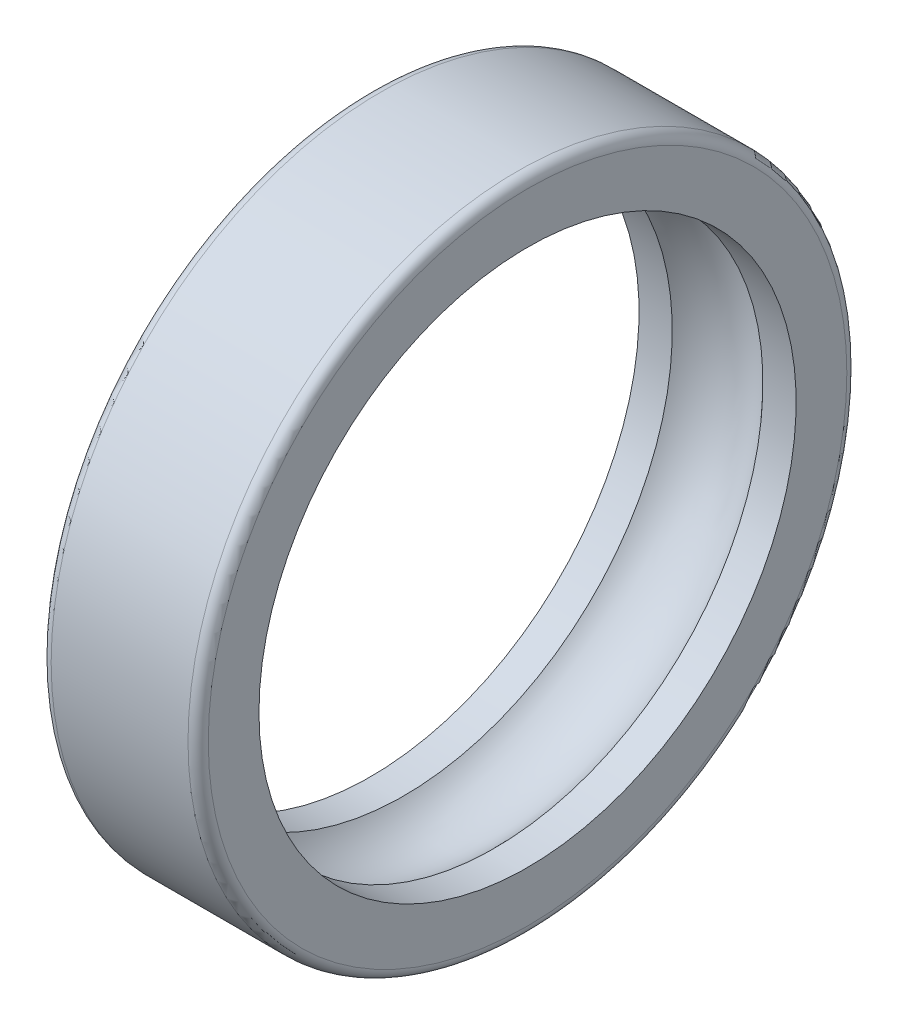
ISO-10303-21;
HEADER;
FILE_DESCRIPTION(('STEP AP214'),'2;1');
FILE_NAME('part.step','',(''),(''),'','','');
FILE_SCHEMA(('AUTOMOTIVE_DESIGN { 1 0 10303 214 1 1 1 1 }'));
ENDSEC;
DATA;
#1=APPLICATION_CONTEXT('core data for automotive mechanical design processes');
#2=APPLICATION_PROTOCOL_DEFINITION('international standard','automotive_design',2000,#1);
#3=PRODUCT_CONTEXT('',#1,'mechanical');
#4=PRODUCT('Part','Part','',(#3));
#5=PRODUCT_RELATED_PRODUCT_CATEGORY('part','',(#4));
#6=PRODUCT_DEFINITION_FORMATION('','',#4);
#7=PRODUCT_DEFINITION_CONTEXT('part definition',#1,'design');
#8=PRODUCT_DEFINITION('design','',#6,#7);
#9=PRODUCT_DEFINITION_SHAPE('','',#8);
#10=(LENGTH_UNIT() NAMED_UNIT(*) SI_UNIT(.MILLI.,.METRE.));
#11=(NAMED_UNIT(*) PLANE_ANGLE_UNIT() SI_UNIT($,.RADIAN.));
#12=(NAMED_UNIT(*) SI_UNIT($,.STERADIAN.) SOLID_ANGLE_UNIT());
#13=UNCERTAINTY_MEASURE_WITH_UNIT(LENGTH_MEASURE(1.E-05),#10,'distance_accuracy_value','');
#14=(GEOMETRIC_REPRESENTATION_CONTEXT(3) GLOBAL_UNCERTAINTY_ASSIGNED_CONTEXT((#13)) GLOBAL_UNIT_ASSIGNED_CONTEXT((#10,
#11,#12)) REPRESENTATION_CONTEXT('',''));
#15=CARTESIAN_POINT('',(0.,0.,0.));
#16=DIRECTION('',(0.,0.,1.));
#17=DIRECTION('',(1.,0.,0.));
#18=AXIS2_PLACEMENT_3D('',#15,#16,#17);
#19=CARTESIAN_POINT('',(-15.5,0.,0.));
#20=DIRECTION('',(-1.,0.,0.));
#21=DIRECTION('',(0.,0.,1.));
#22=AXIS2_PLACEMENT_3D('',#19,#20,#21);
#23=CYLINDRICAL_SURFACE('',#22,53.);
#24=CARTESIAN_POINT('',(-8.94427190999916,0.,0.));
#25=DIRECTION('',(-1.,0.,0.));
#26=DIRECTION('',(0.,0.,1.));
#27=AXIS2_PLACEMENT_3D('',#24,#25,#26);
#28=CIRCLE('',#27,53.);
#29=CARTESIAN_POINT('',(-8.94427190999916,0.,53.));
#30=VERTEX_POINT('',#29);
#31=EDGE_CURVE('E73',#30,#30,#28,.T.);
#32=ORIENTED_EDGE('',*,*,#31,.F.);
#33=EDGE_LOOP('',(#32));
#34=FACE_BOUND('',#33,.T.);
#35=CARTESIAN_POINT('',(-15.5,0.,0.));
#36=DIRECTION('',(-1.,0.,0.));
#37=DIRECTION('',(0.,0.,1.));
#38=AXIS2_PLACEMENT_3D('',#35,#36,#37);
#39=CIRCLE('',#38,53.);
#40=CARTESIAN_POINT('',(-15.5,0.,53.));
#41=VERTEX_POINT('',#40);
#42=EDGE_CURVE('E61',#41,#41,#39,.T.);
#43=ORIENTED_EDGE('',*,*,#42,.T.);
#44=EDGE_LOOP('',(#43));
#45=FACE_BOUND('',#44,.T.);
#46=ADVANCED_FACE('F37',(#34,#45),#23,.F.);
#47=CARTESIAN_POINT('',(-15.5,65.,0.));
#48=DIRECTION('',(1.,0.,0.));
#49=DIRECTION('',(0.,0.,-1.));
#50=AXIS2_PLACEMENT_3D('',#47,#48,#49);
#51=PLANE('',#50);
#52=CARTESIAN_POINT('',(-15.5,0.,0.));
#53=DIRECTION('',(1.,0.,0.));
#54=DIRECTION('',(0.,0.,-1.));
#55=AXIS2_PLACEMENT_3D('',#52,#53,#54);
#56=CIRCLE('',#55,63.);
#57=CARTESIAN_POINT('',(-15.5,0.,-63.));
#58=VERTEX_POINT('',#57);
#59=EDGE_CURVE('E10',#58,#58,#56,.F.);
#60=ORIENTED_EDGE('',*,*,#59,.T.);
#61=EDGE_LOOP('',(#60));
#62=FACE_BOUND('',#61,.T.);
#63=ORIENTED_EDGE('',*,*,#42,.F.);
#64=EDGE_LOOP('',(#63));
#65=FACE_BOUND('',#64,.T.);
#66=ADVANCED_FACE('F82',(#62,#65),#51,.F.);
#67=CARTESIAN_POINT('',(-15.5,0.,0.));
#68=DIRECTION('',(-1.,0.,0.));
#69=DIRECTION('',(0.,0.,1.));
#70=AXIS2_PLACEMENT_3D('',#67,#68,#69);
#71=CYLINDRICAL_SURFACE('',#70,65.);
#72=CARTESIAN_POINT('',(13.5,0.,0.));
#73=DIRECTION('',(-1.,0.,0.));
#74=DIRECTION('',(0.,0.,1.));
#75=AXIS2_PLACEMENT_3D('',#72,#73,#74);
#76=CIRCLE('',#75,65.);
#77=CARTESIAN_POINT('',(13.5,0.,65.));
#78=VERTEX_POINT('',#77);
#79=EDGE_CURVE('E50',#78,#78,#76,.T.);
#80=ORIENTED_EDGE('',*,*,#79,.T.);
#81=EDGE_LOOP('',(#80));
#82=FACE_BOUND('',#81,.T.);
#83=CARTESIAN_POINT('',(-13.5,0.,0.));
#84=DIRECTION('',(1.,0.,0.));
#85=DIRECTION('',(0.,0.,-1.));
#86=AXIS2_PLACEMENT_3D('',#83,#84,#85);
#87=CIRCLE('',#86,65.);
#88=CARTESIAN_POINT('',(-13.5,0.,-65.));
#89=VERTEX_POINT('',#88);
#90=EDGE_CURVE('E55',#89,#89,#87,.T.);
#91=ORIENTED_EDGE('',*,*,#90,.T.);
#92=EDGE_LOOP('',(#91));
#93=FACE_BOUND('',#92,.T.);
#94=ADVANCED_FACE('F87',(#82,#93),#71,.T.);
#95=CARTESIAN_POINT('',(15.5,65.,0.));
#96=DIRECTION('',(-1.,0.,0.));
#97=DIRECTION('',(0.,0.,1.));
#98=AXIS2_PLACEMENT_3D('',#95,#96,#97);
#99=PLANE('',#98);
#100=CARTESIAN_POINT('',(15.5,0.,0.));
#101=DIRECTION('',(-1.,0.,0.));
#102=DIRECTION('',(0.,0.,1.));
#103=AXIS2_PLACEMENT_3D('',#100,#101,#102);
#104=CIRCLE('',#103,63.);
#105=CARTESIAN_POINT('',(15.5,0.,63.));
#106=VERTEX_POINT('',#105);
#107=EDGE_CURVE('E45',#106,#106,#104,.F.);
#108=ORIENTED_EDGE('',*,*,#107,.T.);
#109=EDGE_LOOP('',(#108));
#110=FACE_BOUND('',#109,.T.);
#111=CARTESIAN_POINT('',(15.5,0.,0.));
#112=DIRECTION('',(-1.,0.,0.));
#113=DIRECTION('',(0.,0.,1.));
#114=AXIS2_PLACEMENT_3D('',#111,#112,#113);
#115=CIRCLE('',#114,53.);
#116=CARTESIAN_POINT('',(15.5,0.,53.));
#117=VERTEX_POINT('',#116);
#118=EDGE_CURVE('E65',#117,#117,#115,.T.);
#119=ORIENTED_EDGE('',*,*,#118,.T.);
#120=EDGE_LOOP('',(#119));
#121=FACE_BOUND('',#120,.T.);
#122=ADVANCED_FACE('F92',(#110,#121),#99,.F.);
#123=CARTESIAN_POINT('',(-15.5,0.,0.));
#124=DIRECTION('',(-1.,0.,0.));
#125=DIRECTION('',(0.,0.,1.));
#126=AXIS2_PLACEMENT_3D('',#123,#124,#125);
#127=CYLINDRICAL_SURFACE('',#126,53.);
#128=ORIENTED_EDGE('',*,*,#118,.F.);
#129=EDGE_LOOP('',(#128));
#130=FACE_BOUND('',#129,.T.);
#131=CARTESIAN_POINT('',(8.94427190999916,0.,0.));
#132=DIRECTION('',(-1.,0.,0.));
#133=DIRECTION('',(0.,0.,1.));
#134=AXIS2_PLACEMENT_3D('',#131,#132,#133);
#135=CIRCLE('',#134,53.);
#136=CARTESIAN_POINT('',(8.94427190999916,0.,53.));
#137=VERTEX_POINT('',#136);
#138=EDGE_CURVE('E69',#137,#137,#135,.T.);
#139=ORIENTED_EDGE('',*,*,#138,.T.);
#140=EDGE_LOOP('',(#139));
#141=FACE_BOUND('',#140,.T.);
#142=ADVANCED_FACE('F104',(#130,#141),#127,.F.);
#143=CARTESIAN_POINT('',(0.,0.,0.));
#144=DIRECTION('',(-1.,0.,0.));
#145=DIRECTION('',(0.,0.,1.));
#146=AXIS2_PLACEMENT_3D('',#143,#144,#145);
#147=TOROIDAL_SURFACE('',#146,45.,12.);
#148=ORIENTED_EDGE('',*,*,#138,.F.);
#149=EDGE_LOOP('',(#148));
#150=FACE_BOUND('',#149,.T.);
#151=ORIENTED_EDGE('',*,*,#31,.T.);
#152=EDGE_LOOP('',(#151));
#153=FACE_BOUND('',#152,.T.);
#154=ADVANCED_FACE('F78',(#150,#153),#147,.F.);
#155=CARTESIAN_POINT('',(13.5,0.,0.));
#156=DIRECTION('',(-1.,0.,0.));
#157=DIRECTION('',(0.,0.,1.));
#158=AXIS2_PLACEMENT_3D('',#155,#156,#157);
#159=TOROIDAL_SURFACE('',#158,63.,2.);
#160=ORIENTED_EDGE('',*,*,#107,.F.);
#161=EDGE_LOOP('',(#160));
#162=FACE_BOUND('',#161,.T.);
#163=ORIENTED_EDGE('',*,*,#79,.F.);
#164=EDGE_LOOP('',(#163));
#165=FACE_BOUND('',#164,.T.);
#166=ADVANCED_FACE('F96',(#162,#165),#159,.T.);
#167=CARTESIAN_POINT('',(-13.5,0.,0.));
#168=DIRECTION('',(1.,0.,0.));
#169=DIRECTION('',(0.,0.,-1.));
#170=AXIS2_PLACEMENT_3D('',#167,#168,#169);
#171=TOROIDAL_SURFACE('',#170,63.,2.);
#172=ORIENTED_EDGE('',*,*,#90,.F.);
#173=EDGE_LOOP('',(#172));
#174=FACE_BOUND('',#173,.T.);
#175=ORIENTED_EDGE('',*,*,#59,.F.);
#176=EDGE_LOOP('',(#175));
#177=FACE_BOUND('',#176,.T.);
#178=ADVANCED_FACE('F39',(#174,#177),#171,.T.);
#179=CLOSED_SHELL('',(#46,#66,#94,#122,#142,#154,#166,#178));
#180=MANIFOLD_SOLID_BREP('B2',#179);
#181=ADVANCED_BREP_SHAPE_REPRESENTATION('',(#18,#180),#14);
#182=SHAPE_DEFINITION_REPRESENTATION(#9,#181);
ENDSEC;
END-ISO-10303-21;
